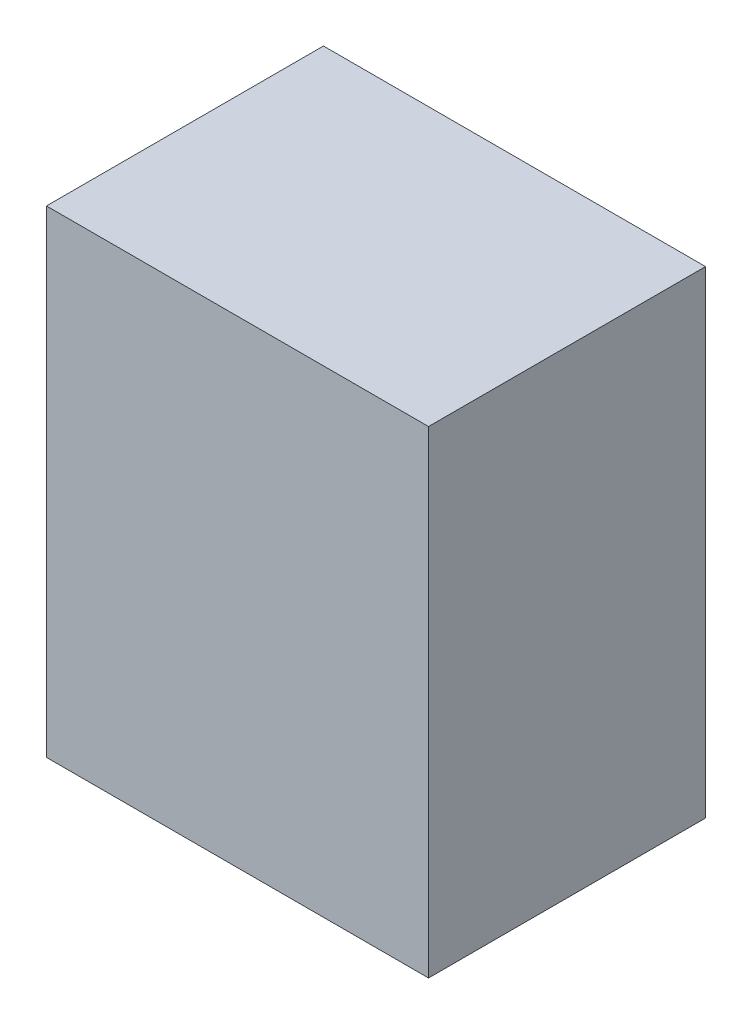
ISO-10303-21;
HEADER;
FILE_DESCRIPTION(('STEP AP214'),'2;1');
FILE_NAME('part.step','',(''),(''),'','','');
FILE_SCHEMA(('AUTOMOTIVE_DESIGN { 1 0 10303 214 1 1 1 1 }'));
ENDSEC;
DATA;
#1=APPLICATION_CONTEXT('core data for automotive mechanical design processes');
#2=APPLICATION_PROTOCOL_DEFINITION('international standard','automotive_design',2000,#1);
#3=PRODUCT_CONTEXT('',#1,'mechanical');
#4=PRODUCT('Part','Part','',(#3));
#5=PRODUCT_RELATED_PRODUCT_CATEGORY('part','',(#4));
#6=PRODUCT_DEFINITION_FORMATION('','',#4);
#7=PRODUCT_DEFINITION_CONTEXT('part definition',#1,'design');
#8=PRODUCT_DEFINITION('design','',#6,#7);
#9=PRODUCT_DEFINITION_SHAPE('','',#8);
#10=(LENGTH_UNIT() NAMED_UNIT(*) SI_UNIT(.MILLI.,.METRE.));
#11=(NAMED_UNIT(*) PLANE_ANGLE_UNIT() SI_UNIT($,.RADIAN.));
#12=(NAMED_UNIT(*) SI_UNIT($,.STERADIAN.) SOLID_ANGLE_UNIT());
#13=UNCERTAINTY_MEASURE_WITH_UNIT(LENGTH_MEASURE(1.E-05),#10,'distance_accuracy_value','');
#14=(GEOMETRIC_REPRESENTATION_CONTEXT(3) GLOBAL_UNCERTAINTY_ASSIGNED_CONTEXT((#13)) GLOBAL_UNIT_ASSIGNED_CONTEXT((#10,
#11,#12)) REPRESENTATION_CONTEXT('',''));
#15=CARTESIAN_POINT('',(0.,0.,0.));
#16=DIRECTION('',(0.,0.,1.));
#17=DIRECTION('',(1.,0.,0.));
#18=AXIS2_PLACEMENT_3D('',#15,#16,#17);
#19=CARTESIAN_POINT('',(0.3999992,-0.499999,0.58000138));
#20=DIRECTION('',(0.,0.,1.));
#21=DIRECTION('',(1.,0.,0.));
#22=AXIS2_PLACEMENT_3D('',#19,#20,#21);
#23=PLANE('',#22);
#24=DIRECTION('',(0.,1.,0.));
#25=VECTOR('',#24,1.);
#26=CARTESIAN_POINT('',(-0.3999992,-0.499999,0.58000138));
#27=LINE('',#26,#25);
#28=CARTESIAN_POINT('',(-0.3999992,-0.499999,0.58000138));
#29=VERTEX_POINT('',#28);
#30=CARTESIAN_POINT('',(-0.3999992,0.499999,0.58000138));
#31=VERTEX_POINT('',#30);
#32=EDGE_CURVE('E53',#29,#31,#27,.T.);
#33=ORIENTED_EDGE('',*,*,#32,.F.);
#34=DIRECTION('',(1.,0.,0.));
#35=VECTOR('',#34,1.);
#36=CARTESIAN_POINT('',(0.3999992,-0.499999,0.58000138));
#37=LINE('',#36,#35);
#38=CARTESIAN_POINT('',(0.3999992,-0.499999,0.58000138));
#39=VERTEX_POINT('',#38);
#40=EDGE_CURVE('E68',#39,#29,#37,.F.);
#41=ORIENTED_EDGE('',*,*,#40,.F.);
#42=DIRECTION('',(0.,1.,0.));
#43=VECTOR('',#42,1.);
#44=CARTESIAN_POINT('',(0.3999992,0.499999,0.58000138));
#45=LINE('',#44,#43);
#46=CARTESIAN_POINT('',(0.3999992,0.499999,0.58000138));
#47=VERTEX_POINT('',#46);
#48=EDGE_CURVE('E20',#47,#39,#45,.F.);
#49=ORIENTED_EDGE('',*,*,#48,.F.);
#50=DIRECTION('',(1.,0.,0.));
#51=VECTOR('',#50,1.);
#52=CARTESIAN_POINT('',(-0.3999992,0.499999,0.58000138));
#53=LINE('',#52,#51);
#54=EDGE_CURVE('E58',#31,#47,#53,.T.);
#55=ORIENTED_EDGE('',*,*,#54,.F.);
#56=EDGE_LOOP('',(#33,#41,#49,#55));
#57=FACE_BOUND('',#56,.T.);
#58=ADVANCED_FACE('F17',(#57),#23,.T.);
#59=CARTESIAN_POINT('',(0.3999992,0.499999,0.));
#60=DIRECTION('',(1.,0.,0.));
#61=DIRECTION('',(0.,0.,-1.));
#62=AXIS2_PLACEMENT_3D('',#59,#60,#61);
#63=PLANE('',#62);
#64=DIRECTION('',(0.,0.,-1.));
#65=VECTOR('',#64,1.);
#66=CARTESIAN_POINT('',(0.3999992,-0.499999,0.));
#67=LINE('',#66,#65);
#68=CARTESIAN_POINT('',(0.3999992,-0.499999,0.));
#69=VERTEX_POINT('',#68);
#70=EDGE_CURVE('E79',#69,#39,#67,.F.);
#71=ORIENTED_EDGE('',*,*,#70,.F.);
#72=DIRECTION('',(0.,1.,0.));
#73=VECTOR('',#72,1.);
#74=CARTESIAN_POINT('',(0.3999992,-0.499999,0.));
#75=LINE('',#74,#73);
#76=CARTESIAN_POINT('',(0.3999992,0.499999,0.));
#77=VERTEX_POINT('',#76);
#78=EDGE_CURVE('E74',#69,#77,#75,.T.);
#79=ORIENTED_EDGE('',*,*,#78,.T.);
#80=DIRECTION('',(0.,0.,1.));
#81=VECTOR('',#80,1.);
#82=CARTESIAN_POINT('',(0.3999992,0.499999,0.));
#83=LINE('',#82,#81);
#84=EDGE_CURVE('E63',#47,#77,#83,.F.);
#85=ORIENTED_EDGE('',*,*,#84,.F.);
#86=ORIENTED_EDGE('',*,*,#48,.T.);
#87=EDGE_LOOP('',(#71,#79,#85,#86));
#88=FACE_BOUND('',#87,.T.);
#89=ADVANCED_FACE('F73',(#88),#63,.T.);
#90=CARTESIAN_POINT('',(-0.3999992,0.499999,0.));
#91=DIRECTION('',(0.,1.,0.));
#92=DIRECTION('',(0.,0.,1.));
#93=AXIS2_PLACEMENT_3D('',#90,#91,#92);
#94=PLANE('',#93);
#95=ORIENTED_EDGE('',*,*,#84,.T.);
#96=DIRECTION('',(1.,0.,0.));
#97=VECTOR('',#96,1.);
#98=CARTESIAN_POINT('',(0.3999992,0.499999,0.));
#99=LINE('',#98,#97);
#100=CARTESIAN_POINT('',(-0.3999992,0.499999,0.));
#101=VERTEX_POINT('',#100);
#102=EDGE_CURVE('E84',#77,#101,#99,.F.);
#103=ORIENTED_EDGE('',*,*,#102,.T.);
#104=DIRECTION('',(0.,0.,1.));
#105=VECTOR('',#104,1.);
#106=CARTESIAN_POINT('',(-0.3999992,0.499999,0.));
#107=LINE('',#106,#105);
#108=EDGE_CURVE('E65',#31,#101,#107,.F.);
#109=ORIENTED_EDGE('',*,*,#108,.F.);
#110=ORIENTED_EDGE('',*,*,#54,.T.);
#111=EDGE_LOOP('',(#95,#103,#109,#110));
#112=FACE_BOUND('',#111,.T.);
#113=ADVANCED_FACE('F60',(#112),#94,.T.);
#114=CARTESIAN_POINT('',(-0.3999992,-0.499999,0.));
#115=DIRECTION('',(-1.,0.,0.));
#116=DIRECTION('',(0.,0.,1.));
#117=AXIS2_PLACEMENT_3D('',#114,#115,#116);
#118=PLANE('',#117);
#119=ORIENTED_EDGE('',*,*,#108,.T.);
#120=DIRECTION('',(0.,1.,0.));
#121=VECTOR('',#120,1.);
#122=CARTESIAN_POINT('',(-0.3999992,-0.499999,0.));
#123=LINE('',#122,#121);
#124=CARTESIAN_POINT('',(-0.3999992,-0.499999,0.));
#125=VERTEX_POINT('',#124);
#126=EDGE_CURVE('E26',#101,#125,#123,.F.);
#127=ORIENTED_EDGE('',*,*,#126,.T.);
#128=DIRECTION('',(0.,0.,-1.));
#129=VECTOR('',#128,1.);
#130=CARTESIAN_POINT('',(-0.3999992,-0.499999,0.));
#131=LINE('',#130,#129);
#132=EDGE_CURVE('E34',#29,#125,#131,.T.);
#133=ORIENTED_EDGE('',*,*,#132,.F.);
#134=ORIENTED_EDGE('',*,*,#32,.T.);
#135=EDGE_LOOP('',(#119,#127,#133,#134));
#136=FACE_BOUND('',#135,.T.);
#137=ADVANCED_FACE('F88',(#136),#118,.T.);
#138=CARTESIAN_POINT('',(0.3999992,-0.499999,0.));
#139=DIRECTION('',(0.,-1.,0.));
#140=DIRECTION('',(0.,0.,-1.));
#141=AXIS2_PLACEMENT_3D('',#138,#139,#140);
#142=PLANE('',#141);
#143=ORIENTED_EDGE('',*,*,#132,.T.);
#144=DIRECTION('',(1.,0.,0.));
#145=VECTOR('',#144,1.);
#146=CARTESIAN_POINT('',(0.3999992,-0.499999,0.));
#147=LINE('',#146,#145);
#148=EDGE_CURVE('E11',#125,#69,#147,.T.);
#149=ORIENTED_EDGE('',*,*,#148,.T.);
#150=ORIENTED_EDGE('',*,*,#70,.T.);
#151=ORIENTED_EDGE('',*,*,#40,.T.);
#152=EDGE_LOOP('',(#143,#149,#150,#151));
#153=FACE_BOUND('',#152,.T.);
#154=ADVANCED_FACE('F91',(#153),#142,.T.);
#155=CARTESIAN_POINT('',(0.3999992,-0.499999,0.));
#156=DIRECTION('',(0.,0.,1.));
#157=DIRECTION('',(1.,0.,0.));
#158=AXIS2_PLACEMENT_3D('',#155,#156,#157);
#159=PLANE('',#158);
#160=ORIENTED_EDGE('',*,*,#126,.F.);
#161=ORIENTED_EDGE('',*,*,#102,.F.);
#162=ORIENTED_EDGE('',*,*,#78,.F.);
#163=ORIENTED_EDGE('',*,*,#148,.F.);
#164=EDGE_LOOP('',(#160,#161,#162,#163));
#165=FACE_BOUND('',#164,.T.);
#166=ADVANCED_FACE('F90',(#165),#159,.F.);
#167=CLOSED_SHELL('',(#58,#89,#113,#137,#154,#166));
#168=MANIFOLD_SOLID_BREP('B1',#167);
#169=ADVANCED_BREP_SHAPE_REPRESENTATION('',(#18,#168),#14);
#170=SHAPE_DEFINITION_REPRESENTATION(#9,#169);
ENDSEC;
END-ISO-10303-21;
